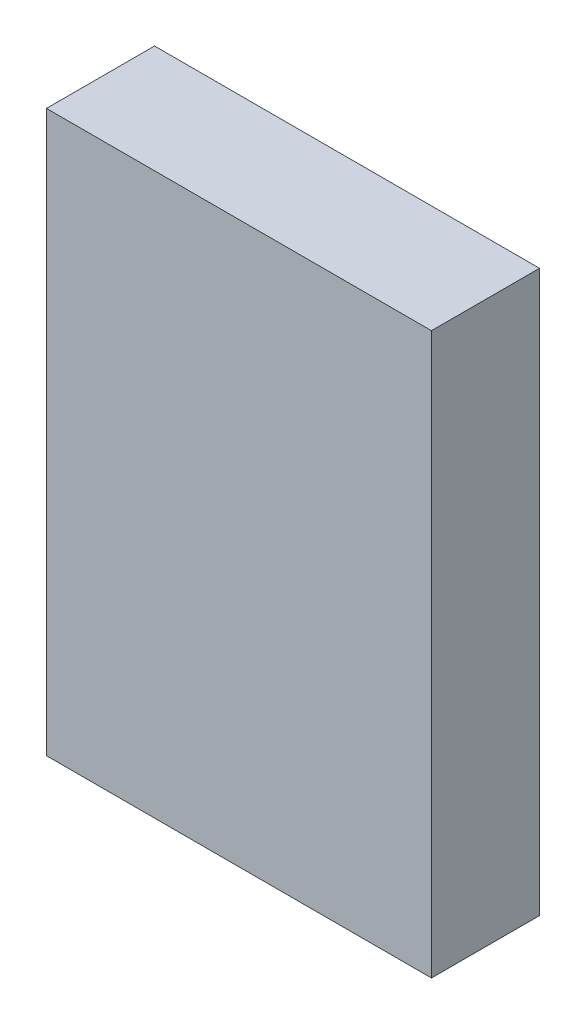
ISO-10303-21;
HEADER;
FILE_DESCRIPTION(('STEP AP214'),'2;1');
FILE_NAME('part.step','',(''),(''),'','','');
FILE_SCHEMA(('AUTOMOTIVE_DESIGN { 1 0 10303 214 1 1 1 1 }'));
ENDSEC;
DATA;
#1=APPLICATION_CONTEXT('core data for automotive mechanical design processes');
#2=APPLICATION_PROTOCOL_DEFINITION('international standard','automotive_design',2000,#1);
#3=PRODUCT_CONTEXT('',#1,'mechanical');
#4=PRODUCT('Part','Part','',(#3));
#5=PRODUCT_RELATED_PRODUCT_CATEGORY('part','',(#4));
#6=PRODUCT_DEFINITION_FORMATION('','',#4);
#7=PRODUCT_DEFINITION_CONTEXT('part definition',#1,'design');
#8=PRODUCT_DEFINITION('design','',#6,#7);
#9=PRODUCT_DEFINITION_SHAPE('','',#8);
#10=(LENGTH_UNIT() NAMED_UNIT(*) SI_UNIT(.MILLI.,.METRE.));
#11=(NAMED_UNIT(*) PLANE_ANGLE_UNIT() SI_UNIT($,.RADIAN.));
#12=(NAMED_UNIT(*) SI_UNIT($,.STERADIAN.) SOLID_ANGLE_UNIT());
#13=UNCERTAINTY_MEASURE_WITH_UNIT(LENGTH_MEASURE(1.E-05),#10,'distance_accuracy_value','');
#14=(GEOMETRIC_REPRESENTATION_CONTEXT(3) GLOBAL_UNCERTAINTY_ASSIGNED_CONTEXT((#13)) GLOBAL_UNIT_ASSIGNED_CONTEXT((#10,
#11,#12)) REPRESENTATION_CONTEXT('',''));
#15=CARTESIAN_POINT('',(0.,0.,0.));
#16=DIRECTION('',(0.,0.,1.));
#17=DIRECTION('',(1.,0.,0.));
#18=AXIS2_PLACEMENT_3D('',#15,#16,#17);
#19=CARTESIAN_POINT('',(0.,0.,16.));
#20=DIRECTION('',(0.,1.,0.));
#21=DIRECTION('',(0.,0.,1.));
#22=AXIS2_PLACEMENT_3D('',#19,#20,#21);
#23=PLANE('',#22);
#24=DIRECTION('',(1.,0.,0.));
#25=VECTOR('',#24,1.);
#26=CARTESIAN_POINT('',(0.,0.,0.));
#27=LINE('',#26,#25);
#28=CARTESIAN_POINT('',(-57.,0.,0.));
#29=VERTEX_POINT('',#28);
#30=CARTESIAN_POINT('',(0.,0.,0.));
#31=VERTEX_POINT('',#30);
#32=EDGE_CURVE('E113',#29,#31,#27,.T.);
#33=ORIENTED_EDGE('',*,*,#32,.T.);
#34=DIRECTION('',(0.,0.,-1.));
#35=VECTOR('',#34,1.);
#36=CARTESIAN_POINT('',(0.,0.,16.));
#37=LINE('',#36,#35);
#38=CARTESIAN_POINT('',(0.,0.,16.));
#39=VERTEX_POINT('',#38);
#40=EDGE_CURVE('E11',#39,#31,#37,.T.);
#41=ORIENTED_EDGE('',*,*,#40,.F.);
#42=DIRECTION('',(1.,0.,0.));
#43=VECTOR('',#42,1.);
#44=CARTESIAN_POINT('',(0.,0.,16.));
#45=LINE('',#44,#43);
#46=CARTESIAN_POINT('',(-57.,0.,16.));
#47=VERTEX_POINT('',#46);
#48=EDGE_CURVE('E97',#47,#39,#45,.T.);
#49=ORIENTED_EDGE('',*,*,#48,.F.);
#50=DIRECTION('',(0.,0.,-1.));
#51=VECTOR('',#50,1.);
#52=CARTESIAN_POINT('',(-57.,0.,16.));
#53=LINE('',#52,#51);
#54=EDGE_CURVE('E109',#47,#29,#53,.T.);
#55=ORIENTED_EDGE('',*,*,#54,.T.);
#56=EDGE_LOOP('',(#33,#41,#49,#55));
#57=FACE_BOUND('',#56,.T.);
#58=ADVANCED_FACE('F45',(#57),#23,.F.);
#59=CARTESIAN_POINT('',(0.,0.,16.));
#60=DIRECTION('',(-1.,0.,0.));
#61=DIRECTION('',(0.,0.,1.));
#62=AXIS2_PLACEMENT_3D('',#59,#60,#61);
#63=PLANE('',#62);
#64=DIRECTION('',(0.,1.,0.));
#65=VECTOR('',#64,1.);
#66=CARTESIAN_POINT('',(0.,0.,0.));
#67=LINE('',#66,#65);
#68=CARTESIAN_POINT('',(0.,83.,0.));
#69=VERTEX_POINT('',#68);
#70=EDGE_CURVE('E102',#31,#69,#67,.T.);
#71=ORIENTED_EDGE('',*,*,#70,.T.);
#72=DIRECTION('',(0.,0.,-1.));
#73=VECTOR('',#72,1.);
#74=CARTESIAN_POINT('',(0.,83.,16.));
#75=LINE('',#74,#73);
#76=CARTESIAN_POINT('',(0.,83.,16.));
#77=VERTEX_POINT('',#76);
#78=EDGE_CURVE('E54',#77,#69,#75,.T.);
#79=ORIENTED_EDGE('',*,*,#78,.F.);
#80=DIRECTION('',(0.,1.,0.));
#81=VECTOR('',#80,1.);
#82=CARTESIAN_POINT('',(0.,0.,16.));
#83=LINE('',#82,#81);
#84=EDGE_CURVE('E92',#39,#77,#83,.T.);
#85=ORIENTED_EDGE('',*,*,#84,.F.);
#86=ORIENTED_EDGE('',*,*,#40,.T.);
#87=EDGE_LOOP('',(#71,#79,#85,#86));
#88=FACE_BOUND('',#87,.T.);
#89=ADVANCED_FACE('F101',(#88),#63,.F.);
#90=CARTESIAN_POINT('',(0.,83.,16.));
#91=DIRECTION('',(0.,-1.,0.));
#92=DIRECTION('',(0.,0.,-1.));
#93=AXIS2_PLACEMENT_3D('',#90,#91,#92);
#94=PLANE('',#93);
#95=DIRECTION('',(-1.,0.,0.));
#96=VECTOR('',#95,1.);
#97=CARTESIAN_POINT('',(0.,83.,0.));
#98=LINE('',#97,#96);
#99=CARTESIAN_POINT('',(-57.,83.,0.));
#100=VERTEX_POINT('',#99);
#101=EDGE_CURVE('E79',#69,#100,#98,.T.);
#102=ORIENTED_EDGE('',*,*,#101,.T.);
#103=DIRECTION('',(0.,0.,-1.));
#104=VECTOR('',#103,1.);
#105=CARTESIAN_POINT('',(-57.,83.,16.));
#106=LINE('',#105,#104);
#107=CARTESIAN_POINT('',(-57.,83.,16.));
#108=VERTEX_POINT('',#107);
#109=EDGE_CURVE('E104',#108,#100,#106,.T.);
#110=ORIENTED_EDGE('',*,*,#109,.F.);
#111=DIRECTION('',(-1.,0.,0.));
#112=VECTOR('',#111,1.);
#113=CARTESIAN_POINT('',(0.,83.,16.));
#114=LINE('',#113,#112);
#115=EDGE_CURVE('E95',#77,#108,#114,.T.);
#116=ORIENTED_EDGE('',*,*,#115,.F.);
#117=ORIENTED_EDGE('',*,*,#78,.T.);
#118=EDGE_LOOP('',(#102,#110,#116,#117));
#119=FACE_BOUND('',#118,.T.);
#120=ADVANCED_FACE('F105',(#119),#94,.F.);
#121=CARTESIAN_POINT('',(-57.,0.,16.));
#122=DIRECTION('',(1.,0.,0.));
#123=DIRECTION('',(0.,0.,-1.));
#124=AXIS2_PLACEMENT_3D('',#121,#122,#123);
#125=PLANE('',#124);
#126=DIRECTION('',(0.,-1.,0.));
#127=VECTOR('',#126,1.);
#128=CARTESIAN_POINT('',(-57.,0.,0.));
#129=LINE('',#128,#127);
#130=EDGE_CURVE('E85',#100,#29,#129,.T.);
#131=ORIENTED_EDGE('',*,*,#130,.T.);
#132=ORIENTED_EDGE('',*,*,#54,.F.);
#133=DIRECTION('',(0.,-1.,0.));
#134=VECTOR('',#133,1.);
#135=CARTESIAN_POINT('',(-57.,0.,16.));
#136=LINE('',#135,#134);
#137=EDGE_CURVE('E62',#108,#47,#136,.T.);
#138=ORIENTED_EDGE('',*,*,#137,.F.);
#139=ORIENTED_EDGE('',*,*,#109,.T.);
#140=EDGE_LOOP('',(#131,#132,#138,#139));
#141=FACE_BOUND('',#140,.T.);
#142=ADVANCED_FACE('F126',(#141),#125,.F.);
#143=CARTESIAN_POINT('',(0.,0.,16.));
#144=DIRECTION('',(0.,0.,-1.));
#145=DIRECTION('',(-1.,0.,0.));
#146=AXIS2_PLACEMENT_3D('',#143,#144,#145);
#147=PLANE('',#146);
#148=ORIENTED_EDGE('',*,*,#48,.T.);
#149=ORIENTED_EDGE('',*,*,#84,.T.);
#150=ORIENTED_EDGE('',*,*,#115,.T.);
#151=ORIENTED_EDGE('',*,*,#137,.T.);
#152=EDGE_LOOP('',(#148,#149,#150,#151));
#153=FACE_BOUND('',#152,.T.);
#154=ADVANCED_FACE('F93',(#153),#147,.F.);
#155=CARTESIAN_POINT('',(0.,0.,0.));
#156=DIRECTION('',(0.,0.,-1.));
#157=DIRECTION('',(-1.,0.,0.));
#158=AXIS2_PLACEMENT_3D('',#155,#156,#157);
#159=PLANE('',#158);
#160=ORIENTED_EDGE('',*,*,#32,.F.);
#161=ORIENTED_EDGE('',*,*,#130,.F.);
#162=ORIENTED_EDGE('',*,*,#101,.F.);
#163=ORIENTED_EDGE('',*,*,#70,.F.);
#164=EDGE_LOOP('',(#160,#161,#162,#163));
#165=FACE_BOUND('',#164,.T.);
#166=ADVANCED_FACE('F129',(#165),#159,.T.);
#167=CLOSED_SHELL('',(#58,#89,#120,#142,#154,#166));
#168=MANIFOLD_SOLID_BREP('B2',#167);
#169=ADVANCED_BREP_SHAPE_REPRESENTATION('',(#18,#168),#14);
#170=SHAPE_DEFINITION_REPRESENTATION(#9,#169);
ENDSEC;
END-ISO-10303-21;
